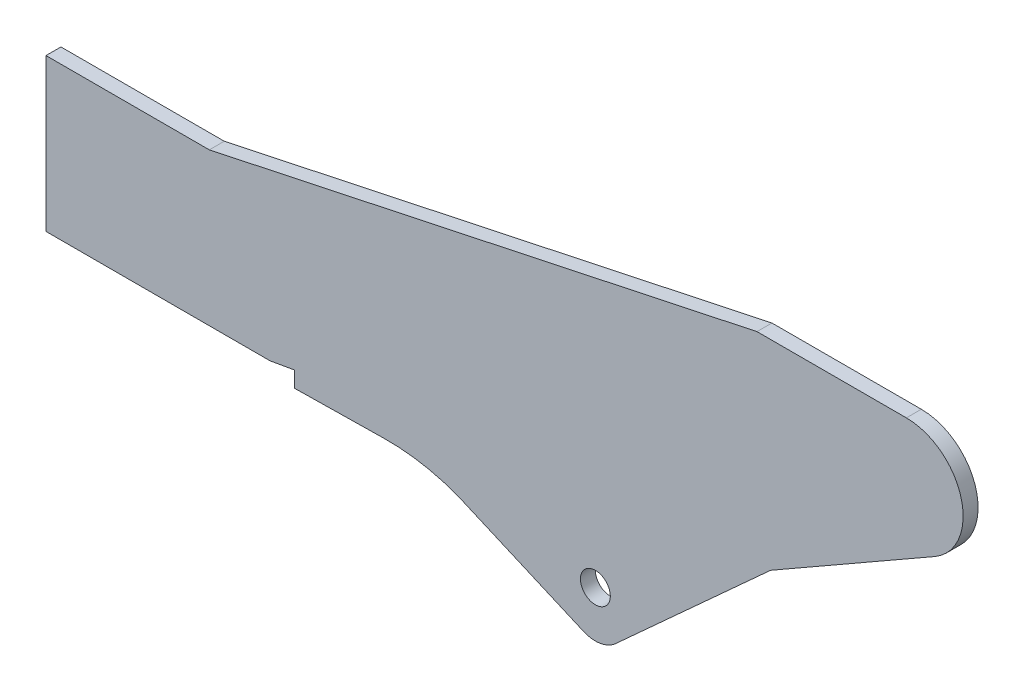
ISO-10303-21;
HEADER;
FILE_DESCRIPTION(('STEP AP214'),'2;1');
FILE_NAME('part.step','',(''),(''),'','','');
FILE_SCHEMA(('AUTOMOTIVE_DESIGN { 1 0 10303 214 1 1 1 1 }'));
ENDSEC;
DATA;
#1=APPLICATION_CONTEXT('core data for automotive mechanical design processes');
#2=APPLICATION_PROTOCOL_DEFINITION('international standard','automotive_design',2000,#1);
#3=PRODUCT_CONTEXT('',#1,'mechanical');
#4=PRODUCT('Part','Part','',(#3));
#5=PRODUCT_RELATED_PRODUCT_CATEGORY('part','',(#4));
#6=PRODUCT_DEFINITION_FORMATION('','',#4);
#7=PRODUCT_DEFINITION_CONTEXT('part definition',#1,'design');
#8=PRODUCT_DEFINITION('design','',#6,#7);
#9=PRODUCT_DEFINITION_SHAPE('','',#8);
#10=(LENGTH_UNIT() NAMED_UNIT(*) SI_UNIT(.MILLI.,.METRE.));
#11=(NAMED_UNIT(*) PLANE_ANGLE_UNIT() SI_UNIT($,.RADIAN.));
#12=(NAMED_UNIT(*) SI_UNIT($,.STERADIAN.) SOLID_ANGLE_UNIT());
#13=UNCERTAINTY_MEASURE_WITH_UNIT(LENGTH_MEASURE(1.E-05),#10,'distance_accuracy_value','');
#14=(GEOMETRIC_REPRESENTATION_CONTEXT(3) GLOBAL_UNCERTAINTY_ASSIGNED_CONTEXT((#13)) GLOBAL_UNIT_ASSIGNED_CONTEXT((#10,
#11,#12)) REPRESENTATION_CONTEXT('',''));
#15=CARTESIAN_POINT('',(0.,0.,0.));
#16=DIRECTION('',(0.,0.,1.));
#17=DIRECTION('',(1.,0.,0.));
#18=AXIS2_PLACEMENT_3D('',#15,#16,#17);
#19=CARTESIAN_POINT('',(342.729786937508,-363.165134107835,7.5));
#20=DIRECTION('',(0.,0.,-1.));
#21=DIRECTION('',(-1.,0.,0.));
#22=AXIS2_PLACEMENT_3D('',#19,#20,#21);
#23=PLANE('',#22);
#24=DIRECTION('',(0.,-1.,0.));
#25=VECTOR('',#24,1.);
#26=CARTESIAN_POINT('',(0.,0.,7.5));
#27=LINE('',#26,#25);
#28=CARTESIAN_POINT('',(0.,0.,7.5));
#29=VERTEX_POINT('',#28);
#30=CARTESIAN_POINT('',(0.,-153.,7.5));
#31=VERTEX_POINT('',#30);
#32=EDGE_CURVE('E224',#29,#31,#27,.T.);
#33=ORIENTED_EDGE('',*,*,#32,.T.);
#34=DIRECTION('',(1.,0.,0.));
#35=VECTOR('',#34,1.);
#36=CARTESIAN_POINT('',(0.,-153.,7.5));
#37=LINE('',#36,#35);
#38=CARTESIAN_POINT('',(225.,-153.,7.5));
#39=VERTEX_POINT('',#38);
#40=EDGE_CURVE('E124',#31,#39,#37,.T.);
#41=ORIENTED_EDGE('',*,*,#40,.T.);
#42=DIRECTION('',(0.984807753012208,0.173648177666931,0.));
#43=VECTOR('',#42,1.);
#44=CARTESIAN_POINT('',(225.,-153.,7.5));
#45=LINE('',#44,#43);
#46=CARTESIAN_POINT('',(249.620193825305,-148.658795558327,7.5));
#47=VERTEX_POINT('',#46);
#48=EDGE_CURVE('E269',#39,#47,#45,.T.);
#49=ORIENTED_EDGE('',*,*,#48,.T.);
#50=DIRECTION('',(0.,-1.,0.));
#51=VECTOR('',#50,1.);
#52=CARTESIAN_POINT('',(249.620193825305,-148.658795558327,7.5));
#53=LINE('',#52,#51);
#54=CARTESIAN_POINT('',(249.620193825305,-164.588795558327,7.5));
#55=VERTEX_POINT('',#54);
#56=EDGE_CURVE('E289',#47,#55,#53,.T.);
#57=ORIENTED_EDGE('',*,*,#56,.T.);
#58=DIRECTION('',(0.999879123077842,0.015547965561017,0.));
#59=VECTOR('',#58,1.);
#60=CARTESIAN_POINT('',(249.620193825305,-164.588795558327,7.5));
#61=LINE('',#60,#59);
#62=CARTESIAN_POINT('',(339.620193825305,-163.189309492267,7.5));
#63=VERTEX_POINT('',#62);
#64=EDGE_CURVE('E285',#55,#63,#61,.T.);
#65=ORIENTED_EDGE('',*,*,#64,.T.);
#66=CARTESIAN_POINT('',(342.729786937508,-363.165134107835,7.5));
#67=DIRECTION('',(0.,0.,-1.));
#68=DIRECTION('',(-1.,0.,0.));
#69=AXIS2_PLACEMENT_3D('',#66,#67,#68);
#70=CIRCLE('',#69,200.);
#71=CARTESIAN_POINT('',(413.142119809445,-175.969772574672,7.5));
#72=VERTEX_POINT('',#71);
#73=EDGE_CURVE('E288',#63,#72,#70,.T.);
#74=ORIENTED_EDGE('',*,*,#73,.T.);
#75=DIRECTION('',(0.917456633379818,-0.397835802646481,0.));
#76=VECTOR('',#75,1.);
#77=CARTESIAN_POINT('',(413.142119809445,-175.969772574672,7.5));
#78=LINE('',#77,#76);
#79=CARTESIAN_POINT('',(539.75113521586,-230.871113339887,7.5));
#80=VERTEX_POINT('',#79);
#81=EDGE_CURVE('E293',#72,#80,#78,.T.);
#82=ORIENTED_EDGE('',*,*,#81,.T.);
#83=CARTESIAN_POINT('',(551.686209295254,-203.347414338492,7.5));
#84=DIRECTION('',(0.,0.,1.));
#85=DIRECTION('',(1.,0.,0.));
#86=AXIS2_PLACEMENT_3D('',#83,#84,#85);
#87=CIRCLE('',#86,30.);
#88=CARTESIAN_POINT('',(571.872200417763,-225.540335786603,7.5));
#89=VERTEX_POINT('',#88);
#90=EDGE_CURVE('E300',#80,#89,#87,.T.);
#91=ORIENTED_EDGE('',*,*,#90,.T.);
#92=DIRECTION('',(0.73976404827036,0.672866370750276,0.));
#93=VECTOR('',#92,1.);
#94=CARTESIAN_POINT('',(571.872200417763,-225.540335786603,7.5));
#95=LINE('',#94,#93);
#96=CARTESIAN_POINT('',(727.653990866988,-83.8460641960463,7.5));
#97=VERTEX_POINT('',#96);
#98=EDGE_CURVE('E303',#89,#97,#95,.T.);
#99=ORIENTED_EDGE('',*,*,#98,.T.);
#100=DIRECTION('',(0.867810619053879,0.496895088984911,0.));
#101=VECTOR('',#100,1.);
#102=CARTESIAN_POINT('',(727.653990866988,-83.8460641960463,7.5));
#103=LINE('',#102,#101);
#104=CARTESIAN_POINT('',(892.32302007214,10.4409036324413,7.5));
#105=VERTEX_POINT('',#104);
#106=EDGE_CURVE('E306',#97,#105,#103,.T.);
#107=ORIENTED_EDGE('',*,*,#106,.T.);
#108=CARTESIAN_POINT('',(864.,59.9061089185125,7.5));
#109=DIRECTION('',(0.,0.,1.));
#110=DIRECTION('',(1.,0.,0.));
#111=AXIS2_PLACEMENT_3D('',#108,#109,#110);
#112=CIRCLE('',#111,57.);
#113=CARTESIAN_POINT('',(864.,116.906108918512,7.5));
#114=VERTEX_POINT('',#113);
#115=EDGE_CURVE('E161',#105,#114,#112,.T.);
#116=ORIENTED_EDGE('',*,*,#115,.T.);
#117=DIRECTION('',(-1.,0.,0.));
#118=VECTOR('',#117,1.);
#119=CARTESIAN_POINT('',(714.,116.906108918512,7.5));
#120=LINE('',#119,#118);
#121=CARTESIAN_POINT('',(714.,116.906108918512,7.5));
#122=VERTEX_POINT('',#121);
#123=EDGE_CURVE('E155',#114,#122,#120,.T.);
#124=ORIENTED_EDGE('',*,*,#123,.T.);
#125=DIRECTION('',(-0.978147600733805,-0.20791169081776,0.));
#126=VECTOR('',#125,1.);
#127=CARTESIAN_POINT('',(164.,0.,7.5));
#128=LINE('',#127,#126);
#129=CARTESIAN_POINT('',(164.,0.,7.5));
#130=VERTEX_POINT('',#129);
#131=EDGE_CURVE('E159',#122,#130,#128,.T.);
#132=ORIENTED_EDGE('',*,*,#131,.T.);
#133=DIRECTION('',(-1.,0.,0.));
#134=VECTOR('',#133,1.);
#135=CARTESIAN_POINT('',(0.,0.,7.5));
#136=LINE('',#135,#134);
#137=EDGE_CURVE('E63',#130,#29,#136,.T.);
#138=ORIENTED_EDGE('',*,*,#137,.T.);
#139=EDGE_LOOP('',(#33,#41,#49,#57,#65,#74,#82,#91,#99,#107,#116,#124,#132,#138));
#140=FACE_BOUND('',#139,.T.);
#141=CARTESIAN_POINT('',(551.686209295254,-186.833379926325,7.5));
#142=DIRECTION('',(0.,0.,1.));
#143=DIRECTION('',(1.,0.,0.));
#144=AXIS2_PLACEMENT_3D('',#141,#142,#143);
#145=CIRCLE('',#144,15.);
#146=CARTESIAN_POINT('',(566.686209295254,-186.833379926325,7.5));
#147=VERTEX_POINT('',#146);
#148=EDGE_CURVE('E188',#147,#147,#145,.T.);
#149=ORIENTED_EDGE('',*,*,#148,.F.);
#150=EDGE_LOOP('',(#149));
#151=FACE_BOUND('',#150,.T.);
#152=ADVANCED_FACE('F45',(#140,#151),#23,.F.);
#153=CARTESIAN_POINT('',(342.729786937508,-363.165134107835,-7.5));
#154=DIRECTION('',(0.,0.,-1.));
#155=DIRECTION('',(-1.,0.,0.));
#156=AXIS2_PLACEMENT_3D('',#153,#154,#155);
#157=PLANE('',#156);
#158=DIRECTION('',(0.,-1.,0.));
#159=VECTOR('',#158,1.);
#160=CARTESIAN_POINT('',(0.,0.,-7.5));
#161=LINE('',#160,#159);
#162=CARTESIAN_POINT('',(0.,0.,-7.5));
#163=VERTEX_POINT('',#162);
#164=CARTESIAN_POINT('',(0.,-153.,-7.5));
#165=VERTEX_POINT('',#164);
#166=EDGE_CURVE('E183',#163,#165,#161,.T.);
#167=ORIENTED_EDGE('',*,*,#166,.F.);
#168=DIRECTION('',(-1.,0.,0.));
#169=VECTOR('',#168,1.);
#170=CARTESIAN_POINT('',(0.,0.,-7.5));
#171=LINE('',#170,#169);
#172=CARTESIAN_POINT('',(164.,0.,-7.5));
#173=VERTEX_POINT('',#172);
#174=EDGE_CURVE('E116',#173,#163,#171,.T.);
#175=ORIENTED_EDGE('',*,*,#174,.F.);
#176=DIRECTION('',(-0.978147600733805,-0.20791169081776,0.));
#177=VECTOR('',#176,1.);
#178=CARTESIAN_POINT('',(164.,0.,-7.5));
#179=LINE('',#178,#177);
#180=CARTESIAN_POINT('',(714.,116.906108918512,-7.5));
#181=VERTEX_POINT('',#180);
#182=EDGE_CURVE('E110',#181,#173,#179,.T.);
#183=ORIENTED_EDGE('',*,*,#182,.F.);
#184=DIRECTION('',(-1.,0.,0.));
#185=VECTOR('',#184,1.);
#186=CARTESIAN_POINT('',(714.,116.906108918512,-7.5));
#187=LINE('',#186,#185);
#188=CARTESIAN_POINT('',(864.,116.906108918512,-7.5));
#189=VERTEX_POINT('',#188);
#190=EDGE_CURVE('E170',#189,#181,#187,.T.);
#191=ORIENTED_EDGE('',*,*,#190,.F.);
#192=CARTESIAN_POINT('',(864.,59.9061089185125,-7.5));
#193=DIRECTION('',(0.,0.,1.));
#194=DIRECTION('',(1.,0.,0.));
#195=AXIS2_PLACEMENT_3D('',#192,#193,#194);
#196=CIRCLE('',#195,57.);
#197=CARTESIAN_POINT('',(892.32302007214,10.4409036324413,-7.5));
#198=VERTEX_POINT('',#197);
#199=EDGE_CURVE('E215',#198,#189,#196,.T.);
#200=ORIENTED_EDGE('',*,*,#199,.F.);
#201=DIRECTION('',(0.867810619053879,0.496895088984911,0.));
#202=VECTOR('',#201,1.);
#203=CARTESIAN_POINT('',(727.653990866988,-83.8460641960463,-7.5));
#204=LINE('',#203,#202);
#205=CARTESIAN_POINT('',(727.653990866988,-83.8460641960463,-7.5));
#206=VERTEX_POINT('',#205);
#207=EDGE_CURVE('E212',#206,#198,#204,.T.);
#208=ORIENTED_EDGE('',*,*,#207,.F.);
#209=DIRECTION('',(0.73976404827036,0.672866370750276,0.));
#210=VECTOR('',#209,1.);
#211=CARTESIAN_POINT('',(571.872200417763,-225.540335786603,-7.5));
#212=LINE('',#211,#210);
#213=CARTESIAN_POINT('',(571.872200417763,-225.540335786603,-7.5));
#214=VERTEX_POINT('',#213);
#215=EDGE_CURVE('E209',#214,#206,#212,.T.);
#216=ORIENTED_EDGE('',*,*,#215,.F.);
#217=CARTESIAN_POINT('',(551.686209295254,-203.347414338492,-7.5));
#218=DIRECTION('',(0.,0.,1.));
#219=DIRECTION('',(1.,0.,0.));
#220=AXIS2_PLACEMENT_3D('',#217,#218,#219);
#221=CIRCLE('',#220,30.);
#222=CARTESIAN_POINT('',(539.75113521586,-230.871113339887,-7.5));
#223=VERTEX_POINT('',#222);
#224=EDGE_CURVE('E206',#223,#214,#221,.T.);
#225=ORIENTED_EDGE('',*,*,#224,.F.);
#226=DIRECTION('',(0.917456633379818,-0.397835802646481,0.));
#227=VECTOR('',#226,1.);
#228=CARTESIAN_POINT('',(413.142119809445,-175.969772574672,-7.5));
#229=LINE('',#228,#227);
#230=CARTESIAN_POINT('',(413.142119809445,-175.969772574672,-7.5));
#231=VERTEX_POINT('',#230);
#232=EDGE_CURVE('E203',#231,#223,#229,.T.);
#233=ORIENTED_EDGE('',*,*,#232,.F.);
#234=CARTESIAN_POINT('',(342.729786937508,-363.165134107835,-7.5));
#235=DIRECTION('',(0.,0.,-1.));
#236=DIRECTION('',(-1.,0.,0.));
#237=AXIS2_PLACEMENT_3D('',#234,#235,#236);
#238=CIRCLE('',#237,200.);
#239=CARTESIAN_POINT('',(339.620193825305,-163.189309492267,-7.5));
#240=VERTEX_POINT('',#239);
#241=EDGE_CURVE('E200',#240,#231,#238,.T.);
#242=ORIENTED_EDGE('',*,*,#241,.F.);
#243=DIRECTION('',(0.999879123077842,0.015547965561017,0.));
#244=VECTOR('',#243,1.);
#245=CARTESIAN_POINT('',(249.620193825305,-164.588795558327,-7.5));
#246=LINE('',#245,#244);
#247=CARTESIAN_POINT('',(249.620193825305,-164.588795558327,-7.5));
#248=VERTEX_POINT('',#247);
#249=EDGE_CURVE('E197',#248,#240,#246,.T.);
#250=ORIENTED_EDGE('',*,*,#249,.F.);
#251=DIRECTION('',(0.,-1.,0.));
#252=VECTOR('',#251,1.);
#253=CARTESIAN_POINT('',(249.620193825305,-148.658795558327,-7.5));
#254=LINE('',#253,#252);
#255=CARTESIAN_POINT('',(249.620193825305,-148.658795558327,-7.5));
#256=VERTEX_POINT('',#255);
#257=EDGE_CURVE('E194',#256,#248,#254,.T.);
#258=ORIENTED_EDGE('',*,*,#257,.F.);
#259=DIRECTION('',(0.984807753012208,0.173648177666931,0.));
#260=VECTOR('',#259,1.);
#261=CARTESIAN_POINT('',(225.,-153.,-7.5));
#262=LINE('',#261,#260);
#263=CARTESIAN_POINT('',(225.,-153.,-7.5));
#264=VERTEX_POINT('',#263);
#265=EDGE_CURVE('E191',#264,#256,#262,.T.);
#266=ORIENTED_EDGE('',*,*,#265,.F.);
#267=DIRECTION('',(1.,0.,0.));
#268=VECTOR('',#267,1.);
#269=CARTESIAN_POINT('',(0.,-153.,-7.5));
#270=LINE('',#269,#268);
#271=EDGE_CURVE('E187',#165,#264,#270,.T.);
#272=ORIENTED_EDGE('',*,*,#271,.F.);
#273=EDGE_LOOP('',(#167,#175,#183,#191,#200,#208,#216,#225,#233,#242,#250,#258,#266,#272));
#274=FACE_BOUND('',#273,.T.);
#275=CARTESIAN_POINT('',(551.686209295254,-186.833379926325,-7.5));
#276=DIRECTION('',(0.,0.,1.));
#277=DIRECTION('',(1.,0.,0.));
#278=AXIS2_PLACEMENT_3D('',#275,#276,#277);
#279=CIRCLE('',#278,15.);
#280=CARTESIAN_POINT('',(566.686209295254,-186.833379926325,-7.5));
#281=VERTEX_POINT('',#280);
#282=EDGE_CURVE('E481',#281,#281,#279,.T.);
#283=ORIENTED_EDGE('',*,*,#282,.T.);
#284=EDGE_LOOP('',(#283));
#285=FACE_BOUND('',#284,.T.);
#286=ADVANCED_FACE('F273',(#274,#285),#157,.T.);
#287=CARTESIAN_POINT('',(0.,0.,7.5));
#288=DIRECTION('',(1.,0.,0.));
#289=DIRECTION('',(0.,1.,0.));
#290=AXIS2_PLACEMENT_3D('',#287,#288,#289);
#291=PLANE('',#290);
#292=ORIENTED_EDGE('',*,*,#166,.T.);
#293=DIRECTION('',(0.,0.,-1.));
#294=VECTOR('',#293,1.);
#295=CARTESIAN_POINT('',(0.,-153.,7.5));
#296=LINE('',#295,#294);
#297=EDGE_CURVE('E11',#31,#165,#296,.T.);
#298=ORIENTED_EDGE('',*,*,#297,.F.);
#299=ORIENTED_EDGE('',*,*,#32,.F.);
#300=DIRECTION('',(0.,0.,-1.));
#301=VECTOR('',#300,1.);
#302=CARTESIAN_POINT('',(0.,0.,7.5));
#303=LINE('',#302,#301);
#304=EDGE_CURVE('E179',#29,#163,#303,.T.);
#305=ORIENTED_EDGE('',*,*,#304,.T.);
#306=EDGE_LOOP('',(#292,#298,#299,#305));
#307=FACE_BOUND('',#306,.T.);
#308=ADVANCED_FACE('F47',(#307),#291,.F.);
#309=CARTESIAN_POINT('',(0.,-153.,7.5));
#310=DIRECTION('',(0.,1.,0.));
#311=DIRECTION('',(0.,0.,1.));
#312=AXIS2_PLACEMENT_3D('',#309,#310,#311);
#313=PLANE('',#312);
#314=ORIENTED_EDGE('',*,*,#271,.T.);
#315=DIRECTION('',(0.,0.,-1.));
#316=VECTOR('',#315,1.);
#317=CARTESIAN_POINT('',(225.,-153.,7.5));
#318=LINE('',#317,#316);
#319=EDGE_CURVE('E55',#39,#264,#318,.T.);
#320=ORIENTED_EDGE('',*,*,#319,.F.);
#321=ORIENTED_EDGE('',*,*,#40,.F.);
#322=ORIENTED_EDGE('',*,*,#297,.T.);
#323=EDGE_LOOP('',(#314,#320,#321,#322));
#324=FACE_BOUND('',#323,.T.);
#325=ADVANCED_FACE('F342',(#324),#313,.F.);
#326=CARTESIAN_POINT('',(225.,-153.,7.5));
#327=DIRECTION('',(-0.173648177666931,0.984807753012208,0.));
#328=DIRECTION('',(-0.984807753012208,-0.173648177666931,0.));
#329=AXIS2_PLACEMENT_3D('',#326,#327,#328);
#330=PLANE('',#329);
#331=ORIENTED_EDGE('',*,*,#265,.T.);
#332=DIRECTION('',(0.,0.,-1.));
#333=VECTOR('',#332,1.);
#334=CARTESIAN_POINT('',(249.620193825305,-148.658795558327,7.5));
#335=LINE('',#334,#333);
#336=EDGE_CURVE('E259',#47,#256,#335,.T.);
#337=ORIENTED_EDGE('',*,*,#336,.F.);
#338=ORIENTED_EDGE('',*,*,#48,.F.);
#339=ORIENTED_EDGE('',*,*,#319,.T.);
#340=EDGE_LOOP('',(#331,#337,#338,#339));
#341=FACE_BOUND('',#340,.T.);
#342=ADVANCED_FACE('F267',(#341),#330,.F.);
#343=CARTESIAN_POINT('',(249.620193825305,-148.658795558327,7.5));
#344=DIRECTION('',(1.,0.,0.));
#345=DIRECTION('',(0.,0.,-1.));
#346=AXIS2_PLACEMENT_3D('',#343,#344,#345);
#347=PLANE('',#346);
#348=ORIENTED_EDGE('',*,*,#257,.T.);
#349=DIRECTION('',(0.,0.,-1.));
#350=VECTOR('',#349,1.);
#351=CARTESIAN_POINT('',(249.620193825305,-164.588795558327,7.5));
#352=LINE('',#351,#350);
#353=EDGE_CURVE('E255',#55,#248,#352,.T.);
#354=ORIENTED_EDGE('',*,*,#353,.F.);
#355=ORIENTED_EDGE('',*,*,#56,.F.);
#356=ORIENTED_EDGE('',*,*,#336,.T.);
#357=EDGE_LOOP('',(#348,#354,#355,#356));
#358=FACE_BOUND('',#357,.T.);
#359=ADVANCED_FACE('F279',(#358),#347,.F.);
#360=CARTESIAN_POINT('',(249.620193825305,-164.588795558327,7.5));
#361=DIRECTION('',(-0.015547965561017,0.999879123077842,0.));
#362=DIRECTION('',(-0.999879123077842,-0.015547965561017,0.));
#363=AXIS2_PLACEMENT_3D('',#360,#361,#362);
#364=PLANE('',#363);
#365=ORIENTED_EDGE('',*,*,#249,.T.);
#366=DIRECTION('',(0.,0.,-1.));
#367=VECTOR('',#366,1.);
#368=CARTESIAN_POINT('',(339.620193825305,-163.189309492267,7.5));
#369=LINE('',#368,#367);
#370=EDGE_CURVE('E251',#63,#240,#369,.T.);
#371=ORIENTED_EDGE('',*,*,#370,.F.);
#372=ORIENTED_EDGE('',*,*,#64,.F.);
#373=ORIENTED_EDGE('',*,*,#353,.T.);
#374=EDGE_LOOP('',(#365,#371,#372,#373));
#375=FACE_BOUND('',#374,.T.);
#376=ADVANCED_FACE('F283',(#375),#364,.F.);
#377=CARTESIAN_POINT('',(342.729786937508,-363.165134107835,7.5));
#378=DIRECTION('',(0.,0.,-1.));
#379=DIRECTION('',(-1.,0.,0.));
#380=AXIS2_PLACEMENT_3D('',#377,#378,#379);
#381=CYLINDRICAL_SURFACE('',#380,200.);
#382=ORIENTED_EDGE('',*,*,#241,.T.);
#383=DIRECTION('',(0.,0.,-1.));
#384=VECTOR('',#383,1.);
#385=CARTESIAN_POINT('',(413.142119809445,-175.969772574672,7.5));
#386=LINE('',#385,#384);
#387=EDGE_CURVE('E247',#72,#231,#386,.T.);
#388=ORIENTED_EDGE('',*,*,#387,.F.);
#389=ORIENTED_EDGE('',*,*,#73,.F.);
#390=ORIENTED_EDGE('',*,*,#370,.T.);
#391=EDGE_LOOP('',(#382,#388,#389,#390));
#392=FACE_BOUND('',#391,.T.);
#393=ADVANCED_FACE('F355',(#392),#381,.F.);
#394=CARTESIAN_POINT('',(413.142119809445,-175.969772574672,7.5));
#395=DIRECTION('',(0.397835802646481,0.917456633379818,0.));
#396=DIRECTION('',(-0.917456633379818,0.397835802646481,0.));
#397=AXIS2_PLACEMENT_3D('',#394,#395,#396);
#398=PLANE('',#397);
#399=ORIENTED_EDGE('',*,*,#232,.T.);
#400=DIRECTION('',(0.,0.,-1.));
#401=VECTOR('',#400,1.);
#402=CARTESIAN_POINT('',(539.75113521586,-230.871113339887,7.5));
#403=LINE('',#402,#401);
#404=EDGE_CURVE('E243',#80,#223,#403,.T.);
#405=ORIENTED_EDGE('',*,*,#404,.F.);
#406=ORIENTED_EDGE('',*,*,#81,.F.);
#407=ORIENTED_EDGE('',*,*,#387,.T.);
#408=EDGE_LOOP('',(#399,#405,#406,#407));
#409=FACE_BOUND('',#408,.T.);
#410=ADVANCED_FACE('F358',(#409),#398,.F.);
#411=CARTESIAN_POINT('',(551.686209295254,-203.347414338492,7.5));
#412=DIRECTION('',(0.,0.,-1.));
#413=DIRECTION('',(-1.,0.,0.));
#414=AXIS2_PLACEMENT_3D('',#411,#412,#413);
#415=CYLINDRICAL_SURFACE('',#414,30.);
#416=ORIENTED_EDGE('',*,*,#224,.T.);
#417=DIRECTION('',(0.,0.,-1.));
#418=VECTOR('',#417,1.);
#419=CARTESIAN_POINT('',(571.872200417763,-225.540335786603,7.5));
#420=LINE('',#419,#418);
#421=EDGE_CURVE('E239',#89,#214,#420,.T.);
#422=ORIENTED_EDGE('',*,*,#421,.F.);
#423=ORIENTED_EDGE('',*,*,#90,.F.);
#424=ORIENTED_EDGE('',*,*,#404,.T.);
#425=EDGE_LOOP('',(#416,#422,#423,#424));
#426=FACE_BOUND('',#425,.T.);
#427=ADVANCED_FACE('F362',(#426),#415,.T.);
#428=CARTESIAN_POINT('',(571.872200417763,-225.540335786603,7.5));
#429=DIRECTION('',(-0.672866370750276,0.73976404827036,0.));
#430=DIRECTION('',(-0.73976404827036,-0.672866370750276,0.));
#431=AXIS2_PLACEMENT_3D('',#428,#429,#430);
#432=PLANE('',#431);
#433=ORIENTED_EDGE('',*,*,#215,.T.);
#434=DIRECTION('',(0.,0.,-1.));
#435=VECTOR('',#434,1.);
#436=CARTESIAN_POINT('',(727.653990866988,-83.8460641960463,7.5));
#437=LINE('',#436,#435);
#438=EDGE_CURVE('E235',#97,#206,#437,.T.);
#439=ORIENTED_EDGE('',*,*,#438,.F.);
#440=ORIENTED_EDGE('',*,*,#98,.F.);
#441=ORIENTED_EDGE('',*,*,#421,.T.);
#442=EDGE_LOOP('',(#433,#439,#440,#441));
#443=FACE_BOUND('',#442,.T.);
#444=ADVANCED_FACE('F366',(#443),#432,.F.);
#445=CARTESIAN_POINT('',(727.653990866988,-83.8460641960463,7.5));
#446=DIRECTION('',(-0.496895088984911,0.867810619053879,0.));
#447=DIRECTION('',(-0.86781061905388,-0.496895088984911,0.));
#448=AXIS2_PLACEMENT_3D('',#445,#446,#447);
#449=PLANE('',#448);
#450=ORIENTED_EDGE('',*,*,#207,.T.);
#451=DIRECTION('',(0.,0.,-1.));
#452=VECTOR('',#451,1.);
#453=CARTESIAN_POINT('',(892.32302007214,10.4409036324413,7.5));
#454=LINE('',#453,#452);
#455=EDGE_CURVE('E231',#105,#198,#454,.T.);
#456=ORIENTED_EDGE('',*,*,#455,.F.);
#457=ORIENTED_EDGE('',*,*,#106,.F.);
#458=ORIENTED_EDGE('',*,*,#438,.T.);
#459=EDGE_LOOP('',(#450,#456,#457,#458));
#460=FACE_BOUND('',#459,.T.);
#461=ADVANCED_FACE('F314',(#460),#449,.F.);
#462=CARTESIAN_POINT('',(864.,59.9061089185125,7.5));
#463=DIRECTION('',(0.,0.,-1.));
#464=DIRECTION('',(-1.,0.,0.));
#465=AXIS2_PLACEMENT_3D('',#462,#463,#464);
#466=CYLINDRICAL_SURFACE('',#465,57.);
#467=ORIENTED_EDGE('',*,*,#199,.T.);
#468=DIRECTION('',(0.,0.,-1.));
#469=VECTOR('',#468,1.);
#470=CARTESIAN_POINT('',(864.,116.906108918512,7.5));
#471=LINE('',#470,#469);
#472=EDGE_CURVE('E172',#114,#189,#471,.T.);
#473=ORIENTED_EDGE('',*,*,#472,.F.);
#474=ORIENTED_EDGE('',*,*,#115,.F.);
#475=ORIENTED_EDGE('',*,*,#455,.T.);
#476=EDGE_LOOP('',(#467,#473,#474,#475));
#477=FACE_BOUND('',#476,.T.);
#478=ADVANCED_FACE('F318',(#477),#466,.T.);
#479=CARTESIAN_POINT('',(714.,116.906108918512,7.5));
#480=DIRECTION('',(0.,-1.,0.));
#481=DIRECTION('',(0.,0.,-1.));
#482=AXIS2_PLACEMENT_3D('',#479,#480,#481);
#483=PLANE('',#482);
#484=ORIENTED_EDGE('',*,*,#190,.T.);
#485=DIRECTION('',(0.,0.,-1.));
#486=VECTOR('',#485,1.);
#487=CARTESIAN_POINT('',(714.,116.906108918512,7.5));
#488=LINE('',#487,#486);
#489=EDGE_CURVE('E167',#122,#181,#488,.T.);
#490=ORIENTED_EDGE('',*,*,#489,.F.);
#491=ORIENTED_EDGE('',*,*,#123,.F.);
#492=ORIENTED_EDGE('',*,*,#472,.T.);
#493=EDGE_LOOP('',(#484,#490,#491,#492));
#494=FACE_BOUND('',#493,.T.);
#495=ADVANCED_FACE('F168',(#494),#483,.F.);
#496=CARTESIAN_POINT('',(164.,0.,7.5));
#497=DIRECTION('',(0.20791169081776,-0.978147600733806,0.));
#498=DIRECTION('',(0.978147600733806,0.20791169081776,0.));
#499=AXIS2_PLACEMENT_3D('',#496,#497,#498);
#500=PLANE('',#499);
#501=ORIENTED_EDGE('',*,*,#182,.T.);
#502=DIRECTION('',(0.,0.,-1.));
#503=VECTOR('',#502,1.);
#504=CARTESIAN_POINT('',(164.,0.,7.5));
#505=LINE('',#504,#503);
#506=EDGE_CURVE('E173',#130,#173,#505,.T.);
#507=ORIENTED_EDGE('',*,*,#506,.F.);
#508=ORIENTED_EDGE('',*,*,#131,.F.);
#509=ORIENTED_EDGE('',*,*,#489,.T.);
#510=EDGE_LOOP('',(#501,#507,#508,#509));
#511=FACE_BOUND('',#510,.T.);
#512=ADVANCED_FACE('F175',(#511),#500,.F.);
#513=CARTESIAN_POINT('',(0.,0.,7.5));
#514=DIRECTION('',(0.,-1.,0.));
#515=DIRECTION('',(0.,0.,-1.));
#516=AXIS2_PLACEMENT_3D('',#513,#514,#515);
#517=PLANE('',#516);
#518=ORIENTED_EDGE('',*,*,#174,.T.);
#519=ORIENTED_EDGE('',*,*,#304,.F.);
#520=ORIENTED_EDGE('',*,*,#137,.F.);
#521=ORIENTED_EDGE('',*,*,#506,.T.);
#522=EDGE_LOOP('',(#518,#519,#520,#521));
#523=FACE_BOUND('',#522,.T.);
#524=ADVANCED_FACE('F322',(#523),#517,.F.);
#525=CARTESIAN_POINT('',(551.686209295254,-186.833379926325,7.5));
#526=DIRECTION('',(0.,0.,-1.));
#527=DIRECTION('',(-1.,0.,0.));
#528=AXIS2_PLACEMENT_3D('',#525,#526,#527);
#529=CYLINDRICAL_SURFACE('',#528,15.);
#530=ORIENTED_EDGE('',*,*,#148,.T.);
#531=EDGE_LOOP('',(#530));
#532=FACE_BOUND('',#531,.T.);
#533=ORIENTED_EDGE('',*,*,#282,.F.);
#534=EDGE_LOOP('',(#533));
#535=FACE_BOUND('',#534,.T.);
#536=ADVANCED_FACE('F324',(#532,#535),#529,.F.);
#537=CLOSED_SHELL('',(#152,#286,#308,#325,#342,#359,#376,#393,#410,#427,#444,#461,#478,#495,
#512,#524,#536));
#538=MANIFOLD_SOLID_BREP('B2',#537);
#539=ADVANCED_BREP_SHAPE_REPRESENTATION('',(#18,#538),#14);
#540=SHAPE_DEFINITION_REPRESENTATION(#9,#539);
ENDSEC;
END-ISO-10303-21;
